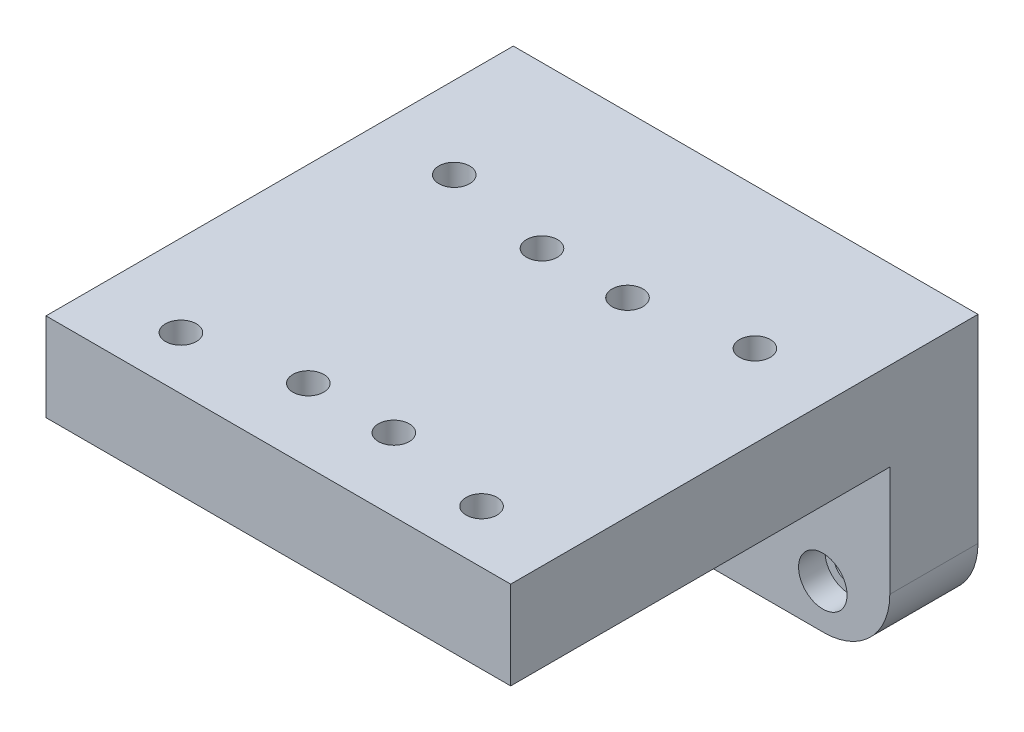
ISO-10303-21;
HEADER;
FILE_DESCRIPTION(('STEP AP214'),'2;1');
FILE_NAME('part.step','',(''),(''),'','','');
FILE_SCHEMA(('AUTOMOTIVE_DESIGN { 1 0 10303 214 1 1 1 1 }'));
ENDSEC;
DATA;
#1=APPLICATION_CONTEXT('core data for automotive mechanical design processes');
#2=APPLICATION_PROTOCOL_DEFINITION('international standard','automotive_design',2000,#1);
#3=PRODUCT_CONTEXT('',#1,'mechanical');
#4=PRODUCT('Part','Part','',(#3));
#5=PRODUCT_RELATED_PRODUCT_CATEGORY('part','',(#4));
#6=PRODUCT_DEFINITION_FORMATION('','',#4);
#7=PRODUCT_DEFINITION_CONTEXT('part definition',#1,'design');
#8=PRODUCT_DEFINITION('design','',#6,#7);
#9=PRODUCT_DEFINITION_SHAPE('','',#8);
#10=(LENGTH_UNIT() NAMED_UNIT(*) SI_UNIT(.MILLI.,.METRE.));
#11=(NAMED_UNIT(*) PLANE_ANGLE_UNIT() SI_UNIT($,.RADIAN.));
#12=(NAMED_UNIT(*) SI_UNIT($,.STERADIAN.) SOLID_ANGLE_UNIT());
#13=UNCERTAINTY_MEASURE_WITH_UNIT(LENGTH_MEASURE(1.E-05),#10,'distance_accuracy_value','');
#14=(GEOMETRIC_REPRESENTATION_CONTEXT(3) GLOBAL_UNCERTAINTY_ASSIGNED_CONTEXT((#13)) GLOBAL_UNIT_ASSIGNED_CONTEXT((#10,
#11,#12)) REPRESENTATION_CONTEXT('',''));
#15=CARTESIAN_POINT('',(0.,0.,0.));
#16=DIRECTION('',(0.,0.,1.));
#17=DIRECTION('',(1.,0.,0.));
#18=AXIS2_PLACEMENT_3D('',#15,#16,#17);
#19=CARTESIAN_POINT('',(0.,13.,0.));
#20=DIRECTION('',(0.,-1.,0.));
#21=DIRECTION('',(0.,0.,-1.));
#22=AXIS2_PLACEMENT_3D('',#19,#20,#21);
#23=PLANE('',#22);
#24=CARTESIAN_POINT('',(34.1,13.,31.));
#25=DIRECTION('',(0.,1.,0.));
#26=DIRECTION('',(0.,0.,-1.));
#27=AXIS2_PLACEMENT_3D('',#24,#25,#26);
#28=CIRCLE('',#27,3.5);
#29=CARTESIAN_POINT('',(34.1,13.,27.5));
#30=VERTEX_POINT('',#29);
#31=EDGE_CURVE('E243',#30,#30,#28,.T.);
#32=ORIENTED_EDGE('',*,*,#31,.F.);
#33=EDGE_LOOP('',(#32));
#34=FACE_BOUND('',#33,.T.);
#35=CARTESIAN_POINT('',(9.70000000000002,13.,26.5));
#36=DIRECTION('',(0.,1.,0.));
#37=DIRECTION('',(0.,0.,-1.));
#38=AXIS2_PLACEMENT_3D('',#35,#36,#37);
#39=CIRCLE('',#38,3.5);
#40=CARTESIAN_POINT('',(9.70000000000002,13.,23.));
#41=VERTEX_POINT('',#40);
#42=EDGE_CURVE('E220',#41,#41,#39,.T.);
#43=ORIENTED_EDGE('',*,*,#42,.F.);
#44=EDGE_LOOP('',(#43));
#45=FACE_BOUND('',#44,.T.);
#46=CARTESIAN_POINT('',(34.1,13.,-31.));
#47=DIRECTION('',(0.,-1.,0.));
#48=DIRECTION('',(0.,0.,1.));
#49=AXIS2_PLACEMENT_3D('',#46,#47,#48);
#50=CIRCLE('',#49,3.5);
#51=CARTESIAN_POINT('',(34.1,13.,-27.5));
#52=VERTEX_POINT('',#51);
#53=EDGE_CURVE('E259',#52,#52,#50,.T.);
#54=ORIENTED_EDGE('',*,*,#53,.T.);
#55=EDGE_LOOP('',(#54));
#56=FACE_BOUND('',#55,.T.);
#57=CARTESIAN_POINT('',(9.70000000000002,13.,-26.5));
#58=DIRECTION('',(0.,-1.,0.));
#59=DIRECTION('',(0.,0.,1.));
#60=AXIS2_PLACEMENT_3D('',#57,#58,#59);
#61=CIRCLE('',#60,3.5);
#62=CARTESIAN_POINT('',(9.70000000000002,13.,-23.));
#63=VERTEX_POINT('',#62);
#64=EDGE_CURVE('E242',#63,#63,#61,.T.);
#65=ORIENTED_EDGE('',*,*,#64,.T.);
#66=EDGE_LOOP('',(#65));
#67=FACE_BOUND('',#66,.T.);
#68=CARTESIAN_POINT('',(-34.1,13.,31.));
#69=DIRECTION('',(0.,-1.,0.));
#70=DIRECTION('',(0.,0.,-1.));
#71=AXIS2_PLACEMENT_3D('',#68,#69,#70);
#72=CIRCLE('',#71,3.5);
#73=CARTESIAN_POINT('',(-34.1,13.,27.5));
#74=VERTEX_POINT('',#73);
#75=EDGE_CURVE('E275',#74,#74,#72,.T.);
#76=ORIENTED_EDGE('',*,*,#75,.T.);
#77=EDGE_LOOP('',(#76));
#78=FACE_BOUND('',#77,.T.);
#79=CARTESIAN_POINT('',(-9.70000000000002,13.,26.5));
#80=DIRECTION('',(0.,-1.,0.));
#81=DIRECTION('',(0.,0.,-1.));
#82=AXIS2_PLACEMENT_3D('',#79,#80,#81);
#83=CIRCLE('',#82,3.5);
#84=CARTESIAN_POINT('',(-9.70000000000002,13.,23.));
#85=VERTEX_POINT('',#84);
#86=EDGE_CURVE('E258',#85,#85,#83,.T.);
#87=ORIENTED_EDGE('',*,*,#86,.T.);
#88=EDGE_LOOP('',(#87));
#89=FACE_BOUND('',#88,.T.);
#90=CARTESIAN_POINT('',(-34.1,13.,-31.));
#91=DIRECTION('',(0.,1.,0.));
#92=DIRECTION('',(0.,0.,1.));
#93=AXIS2_PLACEMENT_3D('',#90,#91,#92);
#94=CIRCLE('',#93,3.5);
#95=CARTESIAN_POINT('',(-34.1,13.,-27.5));
#96=VERTEX_POINT('',#95);
#97=EDGE_CURVE('E291',#96,#96,#94,.T.);
#98=ORIENTED_EDGE('',*,*,#97,.F.);
#99=EDGE_LOOP('',(#98));
#100=FACE_BOUND('',#99,.T.);
#101=CARTESIAN_POINT('',(-9.70000000000002,13.,-26.5));
#102=DIRECTION('',(0.,1.,0.));
#103=DIRECTION('',(0.,0.,1.));
#104=AXIS2_PLACEMENT_3D('',#101,#102,#103);
#105=CIRCLE('',#104,3.5);
#106=CARTESIAN_POINT('',(-9.70000000000002,13.,-23.));
#107=VERTEX_POINT('',#106);
#108=EDGE_CURVE('E295',#107,#107,#105,.T.);
#109=ORIENTED_EDGE('',*,*,#108,.F.);
#110=EDGE_LOOP('',(#109));
#111=FACE_BOUND('',#110,.T.);
#112=DIRECTION('',(0.,0.,1.));
#113=VECTOR('',#112,1.);
#114=CARTESIAN_POINT('',(-52.7,13.,0.));
#115=LINE('',#114,#113);
#116=CARTESIAN_POINT('',(-52.7,13.,-63.));
#117=VERTEX_POINT('',#116);
#118=CARTESIAN_POINT('',(-52.7,13.,43.));
#119=VERTEX_POINT('',#118);
#120=EDGE_CURVE('E176',#117,#119,#115,.T.);
#121=ORIENTED_EDGE('',*,*,#120,.T.);
#122=DIRECTION('',(1.,0.,0.));
#123=VECTOR('',#122,1.);
#124=CARTESIAN_POINT('',(0.,13.,43.));
#125=LINE('',#124,#123);
#126=CARTESIAN_POINT('',(52.7,13.,43.));
#127=VERTEX_POINT('',#126);
#128=EDGE_CURVE('E154',#119,#127,#125,.T.);
#129=ORIENTED_EDGE('',*,*,#128,.T.);
#130=DIRECTION('',(0.,0.,-1.));
#131=VECTOR('',#130,1.);
#132=CARTESIAN_POINT('',(52.7,13.,0.));
#133=LINE('',#132,#131);
#134=CARTESIAN_POINT('',(52.7,13.,-63.));
#135=VERTEX_POINT('',#134);
#136=EDGE_CURVE('E141',#127,#135,#133,.T.);
#137=ORIENTED_EDGE('',*,*,#136,.T.);
#138=DIRECTION('',(-1.,0.,0.));
#139=VECTOR('',#138,1.);
#140=CARTESIAN_POINT('',(0.,13.,-63.));
#141=LINE('',#140,#139);
#142=EDGE_CURVE('E152',#135,#117,#141,.T.);
#143=ORIENTED_EDGE('',*,*,#142,.T.);
#144=EDGE_LOOP('',(#121,#129,#137,#143));
#145=FACE_BOUND('',#144,.T.);
#146=ADVANCED_FACE('F45',(#34,#45,#56,#67,#78,#89,#100,#111,#145),#23,.F.);
#147=CARTESIAN_POINT('',(0.,0.,0.));
#148=DIRECTION('',(0.,-1.,0.));
#149=DIRECTION('',(0.,0.,-1.));
#150=AXIS2_PLACEMENT_3D('',#147,#148,#149);
#151=PLANE('',#150);
#152=CARTESIAN_POINT('',(34.1,0.,31.));
#153=DIRECTION('',(0.,1.,0.));
#154=DIRECTION('',(0.,0.,-1.));
#155=AXIS2_PLACEMENT_3D('',#152,#153,#154);
#156=CIRCLE('',#155,3.5);
#157=CARTESIAN_POINT('',(34.1,0.,27.5));
#158=VERTEX_POINT('',#157);
#159=EDGE_CURVE('E238',#158,#158,#156,.T.);
#160=ORIENTED_EDGE('',*,*,#159,.T.);
#161=EDGE_LOOP('',(#160));
#162=FACE_BOUND('',#161,.T.);
#163=CARTESIAN_POINT('',(9.70000000000002,0.,26.5));
#164=DIRECTION('',(0.,1.,0.));
#165=DIRECTION('',(0.,0.,-1.));
#166=AXIS2_PLACEMENT_3D('',#163,#164,#165);
#167=CIRCLE('',#166,3.5);
#168=CARTESIAN_POINT('',(9.70000000000002,0.,23.));
#169=VERTEX_POINT('',#168);
#170=EDGE_CURVE('E247',#169,#169,#167,.T.);
#171=ORIENTED_EDGE('',*,*,#170,.T.);
#172=EDGE_LOOP('',(#171));
#173=FACE_BOUND('',#172,.T.);
#174=CARTESIAN_POINT('',(34.1,0.,-31.));
#175=DIRECTION('',(0.,-1.,0.));
#176=DIRECTION('',(0.,0.,1.));
#177=AXIS2_PLACEMENT_3D('',#174,#175,#176);
#178=CIRCLE('',#177,3.5);
#179=CARTESIAN_POINT('',(34.1,0.,-27.5));
#180=VERTEX_POINT('',#179);
#181=EDGE_CURVE('E254',#180,#180,#178,.T.);
#182=ORIENTED_EDGE('',*,*,#181,.F.);
#183=EDGE_LOOP('',(#182));
#184=FACE_BOUND('',#183,.T.);
#185=CARTESIAN_POINT('',(9.70000000000002,0.,-26.5));
#186=DIRECTION('',(0.,-1.,0.));
#187=DIRECTION('',(0.,0.,1.));
#188=AXIS2_PLACEMENT_3D('',#185,#186,#187);
#189=CIRCLE('',#188,3.5);
#190=CARTESIAN_POINT('',(9.70000000000002,0.,-23.));
#191=VERTEX_POINT('',#190);
#192=EDGE_CURVE('E263',#191,#191,#189,.T.);
#193=ORIENTED_EDGE('',*,*,#192,.F.);
#194=EDGE_LOOP('',(#193));
#195=FACE_BOUND('',#194,.T.);
#196=CARTESIAN_POINT('',(-34.1,0.,31.));
#197=DIRECTION('',(0.,-1.,0.));
#198=DIRECTION('',(0.,0.,-1.));
#199=AXIS2_PLACEMENT_3D('',#196,#197,#198);
#200=CIRCLE('',#199,3.5);
#201=CARTESIAN_POINT('',(-34.1,0.,27.5));
#202=VERTEX_POINT('',#201);
#203=EDGE_CURVE('E270',#202,#202,#200,.T.);
#204=ORIENTED_EDGE('',*,*,#203,.F.);
#205=EDGE_LOOP('',(#204));
#206=FACE_BOUND('',#205,.T.);
#207=CARTESIAN_POINT('',(-9.70000000000002,0.,26.5));
#208=DIRECTION('',(0.,-1.,0.));
#209=DIRECTION('',(0.,0.,-1.));
#210=AXIS2_PLACEMENT_3D('',#207,#208,#209);
#211=CIRCLE('',#210,3.5);
#212=CARTESIAN_POINT('',(-9.70000000000002,0.,23.));
#213=VERTEX_POINT('',#212);
#214=EDGE_CURVE('E279',#213,#213,#211,.T.);
#215=ORIENTED_EDGE('',*,*,#214,.F.);
#216=EDGE_LOOP('',(#215));
#217=FACE_BOUND('',#216,.T.);
#218=CARTESIAN_POINT('',(-34.1,0.,-31.));
#219=DIRECTION('',(0.,1.,0.));
#220=DIRECTION('',(0.,0.,1.));
#221=AXIS2_PLACEMENT_3D('',#218,#219,#220);
#222=CIRCLE('',#221,3.5);
#223=CARTESIAN_POINT('',(-34.1,0.,-27.5));
#224=VERTEX_POINT('',#223);
#225=EDGE_CURVE('E286',#224,#224,#222,.T.);
#226=ORIENTED_EDGE('',*,*,#225,.T.);
#227=EDGE_LOOP('',(#226));
#228=FACE_BOUND('',#227,.T.);
#229=CARTESIAN_POINT('',(-9.70000000000002,0.,-26.5));
#230=DIRECTION('',(0.,1.,0.));
#231=DIRECTION('',(0.,0.,1.));
#232=AXIS2_PLACEMENT_3D('',#229,#230,#231);
#233=CIRCLE('',#232,3.5);
#234=CARTESIAN_POINT('',(-9.70000000000002,0.,-23.));
#235=VERTEX_POINT('',#234);
#236=EDGE_CURVE('E274',#235,#235,#233,.T.);
#237=ORIENTED_EDGE('',*,*,#236,.T.);
#238=EDGE_LOOP('',(#237));
#239=FACE_BOUND('',#238,.T.);
#240=DIRECTION('',(0.,0.,-1.));
#241=VECTOR('',#240,1.);
#242=CARTESIAN_POINT('',(47.7,0.,38.));
#243=LINE('',#242,#241);
#244=CARTESIAN_POINT('',(47.7,0.,38.));
#245=VERTEX_POINT('',#244);
#246=CARTESIAN_POINT('',(47.7,0.,-38.));
#247=VERTEX_POINT('',#246);
#248=EDGE_CURVE('E290',#245,#247,#243,.T.);
#249=ORIENTED_EDGE('',*,*,#248,.F.);
#250=DIRECTION('',(1.,0.,0.));
#251=VECTOR('',#250,1.);
#252=CARTESIAN_POINT('',(-47.7,0.,38.));
#253=LINE('',#252,#251);
#254=CARTESIAN_POINT('',(-47.7,0.,38.));
#255=VERTEX_POINT('',#254);
#256=EDGE_CURVE('E313',#255,#245,#253,.T.);
#257=ORIENTED_EDGE('',*,*,#256,.F.);
#258=DIRECTION('',(0.,0.,1.));
#259=VECTOR('',#258,1.);
#260=CARTESIAN_POINT('',(-47.7,0.,38.));
#261=LINE('',#260,#259);
#262=CARTESIAN_POINT('',(-47.7,0.,-38.));
#263=VERTEX_POINT('',#262);
#264=EDGE_CURVE('E309',#263,#255,#261,.T.);
#265=ORIENTED_EDGE('',*,*,#264,.F.);
#266=DIRECTION('',(-1.,0.,0.));
#267=VECTOR('',#266,1.);
#268=CARTESIAN_POINT('',(-47.7,0.,-38.));
#269=LINE('',#268,#267);
#270=EDGE_CURVE('E305',#247,#263,#269,.T.);
#271=ORIENTED_EDGE('',*,*,#270,.F.);
#272=EDGE_LOOP('',(#249,#257,#265,#271));
#273=FACE_BOUND('',#272,.T.);
#274=ADVANCED_FACE('F366',(#162,#173,#184,#195,#206,#217,#228,#239,#273),#151,.T.);
#275=CARTESIAN_POINT('',(-9.70000000000002,0.,-26.5));
#276=DIRECTION('',(0.,1.,0.));
#277=DIRECTION('',(0.,0.,1.));
#278=AXIS2_PLACEMENT_3D('',#275,#276,#277);
#279=CYLINDRICAL_SURFACE('',#278,3.5);
#280=ORIENTED_EDGE('',*,*,#236,.F.);
#281=EDGE_LOOP('',(#280));
#282=FACE_BOUND('',#281,.T.);
#283=ORIENTED_EDGE('',*,*,#108,.T.);
#284=EDGE_LOOP('',(#283));
#285=FACE_BOUND('',#284,.T.);
#286=ADVANCED_FACE('F372',(#282,#285),#279,.F.);
#287=CARTESIAN_POINT('',(-34.1,0.,-31.));
#288=DIRECTION('',(0.,1.,0.));
#289=DIRECTION('',(0.,0.,1.));
#290=AXIS2_PLACEMENT_3D('',#287,#288,#289);
#291=CYLINDRICAL_SURFACE('',#290,3.5);
#292=ORIENTED_EDGE('',*,*,#225,.F.);
#293=EDGE_LOOP('',(#292));
#294=FACE_BOUND('',#293,.T.);
#295=ORIENTED_EDGE('',*,*,#97,.T.);
#296=EDGE_LOOP('',(#295));
#297=FACE_BOUND('',#296,.T.);
#298=ADVANCED_FACE('F470',(#294,#297),#291,.F.);
#299=CARTESIAN_POINT('',(-9.70000000000002,0.,26.5));
#300=DIRECTION('',(0.,1.,0.));
#301=DIRECTION('',(0.,0.,1.));
#302=AXIS2_PLACEMENT_3D('',#299,#300,#301);
#303=CYLINDRICAL_SURFACE('',#302,3.5);
#304=ORIENTED_EDGE('',*,*,#214,.T.);
#305=EDGE_LOOP('',(#304));
#306=FACE_BOUND('',#305,.T.);
#307=ORIENTED_EDGE('',*,*,#86,.F.);
#308=EDGE_LOOP('',(#307));
#309=FACE_BOUND('',#308,.T.);
#310=ADVANCED_FACE('F467',(#306,#309),#303,.F.);
#311=CARTESIAN_POINT('',(-34.1,0.,31.));
#312=DIRECTION('',(0.,1.,0.));
#313=DIRECTION('',(0.,0.,1.));
#314=AXIS2_PLACEMENT_3D('',#311,#312,#313);
#315=CYLINDRICAL_SURFACE('',#314,3.5);
#316=ORIENTED_EDGE('',*,*,#203,.T.);
#317=EDGE_LOOP('',(#316));
#318=FACE_BOUND('',#317,.T.);
#319=ORIENTED_EDGE('',*,*,#75,.F.);
#320=EDGE_LOOP('',(#319));
#321=FACE_BOUND('',#320,.T.);
#322=ADVANCED_FACE('F463',(#318,#321),#315,.F.);
#323=CARTESIAN_POINT('',(9.70000000000002,0.,-26.5));
#324=DIRECTION('',(0.,1.,0.));
#325=DIRECTION('',(0.,0.,1.));
#326=AXIS2_PLACEMENT_3D('',#323,#324,#325);
#327=CYLINDRICAL_SURFACE('',#326,3.5);
#328=ORIENTED_EDGE('',*,*,#192,.T.);
#329=EDGE_LOOP('',(#328));
#330=FACE_BOUND('',#329,.T.);
#331=ORIENTED_EDGE('',*,*,#64,.F.);
#332=EDGE_LOOP('',(#331));
#333=FACE_BOUND('',#332,.T.);
#334=ADVANCED_FACE('F459',(#330,#333),#327,.F.);
#335=CARTESIAN_POINT('',(34.1,0.,-31.));
#336=DIRECTION('',(0.,1.,0.));
#337=DIRECTION('',(0.,0.,1.));
#338=AXIS2_PLACEMENT_3D('',#335,#336,#337);
#339=CYLINDRICAL_SURFACE('',#338,3.5);
#340=ORIENTED_EDGE('',*,*,#181,.T.);
#341=EDGE_LOOP('',(#340));
#342=FACE_BOUND('',#341,.T.);
#343=ORIENTED_EDGE('',*,*,#53,.F.);
#344=EDGE_LOOP('',(#343));
#345=FACE_BOUND('',#344,.T.);
#346=ADVANCED_FACE('F451',(#342,#345),#339,.F.);
#347=CARTESIAN_POINT('',(9.70000000000002,0.,26.5));
#348=DIRECTION('',(0.,1.,0.));
#349=DIRECTION('',(0.,0.,1.));
#350=AXIS2_PLACEMENT_3D('',#347,#348,#349);
#351=CYLINDRICAL_SURFACE('',#350,3.5);
#352=ORIENTED_EDGE('',*,*,#170,.F.);
#353=EDGE_LOOP('',(#352));
#354=FACE_BOUND('',#353,.T.);
#355=ORIENTED_EDGE('',*,*,#42,.T.);
#356=EDGE_LOOP('',(#355));
#357=FACE_BOUND('',#356,.T.);
#358=ADVANCED_FACE('F437',(#354,#357),#351,.F.);
#359=CARTESIAN_POINT('',(34.1,0.,31.));
#360=DIRECTION('',(0.,1.,0.));
#361=DIRECTION('',(0.,0.,1.));
#362=AXIS2_PLACEMENT_3D('',#359,#360,#361);
#363=CYLINDRICAL_SURFACE('',#362,3.5);
#364=ORIENTED_EDGE('',*,*,#159,.F.);
#365=EDGE_LOOP('',(#364));
#366=FACE_BOUND('',#365,.T.);
#367=ORIENTED_EDGE('',*,*,#31,.T.);
#368=EDGE_LOOP('',(#367));
#369=FACE_BOUND('',#368,.T.);
#370=ADVANCED_FACE('F432',(#366,#369),#363,.F.);
#371=CARTESIAN_POINT('',(47.7,-7.,0.));
#372=DIRECTION('',(1.,0.,0.));
#373=DIRECTION('',(0.,0.,-1.));
#374=AXIS2_PLACEMENT_3D('',#371,#372,#373);
#375=PLANE('',#374);
#376=ORIENTED_EDGE('',*,*,#248,.T.);
#377=DIRECTION('',(0.,1.,0.));
#378=VECTOR('',#377,1.);
#379=CARTESIAN_POINT('',(47.7,-7.,-38.));
#380=LINE('',#379,#378);
#381=CARTESIAN_POINT('',(47.7,-7.,-38.));
#382=VERTEX_POINT('',#381);
#383=EDGE_CURVE('E216',#382,#247,#380,.T.);
#384=ORIENTED_EDGE('',*,*,#383,.F.);
#385=DIRECTION('',(0.,0.,-1.));
#386=VECTOR('',#385,1.);
#387=CARTESIAN_POINT('',(47.7,-7.,0.));
#388=LINE('',#387,#386);
#389=CARTESIAN_POINT('',(47.7,-7.,38.));
#390=VERTEX_POINT('',#389);
#391=EDGE_CURVE('E198',#390,#382,#388,.T.);
#392=ORIENTED_EDGE('',*,*,#391,.F.);
#393=DIRECTION('',(0.,1.,0.));
#394=VECTOR('',#393,1.);
#395=CARTESIAN_POINT('',(47.7,-7.,38.));
#396=LINE('',#395,#394);
#397=EDGE_CURVE('E229',#390,#245,#396,.T.);
#398=ORIENTED_EDGE('',*,*,#397,.T.);
#399=EDGE_LOOP('',(#376,#384,#392,#398));
#400=FACE_BOUND('',#399,.T.);
#401=ADVANCED_FACE('F426',(#400),#375,.F.);
#402=CARTESIAN_POINT('',(0.,-7.,-38.));
#403=DIRECTION('',(0.,0.,-1.));
#404=DIRECTION('',(-1.,0.,0.));
#405=AXIS2_PLACEMENT_3D('',#402,#403,#404);
#406=PLANE('',#405);
#407=ORIENTED_EDGE('',*,*,#270,.T.);
#408=DIRECTION('',(0.,1.,0.));
#409=VECTOR('',#408,1.);
#410=CARTESIAN_POINT('',(-47.7,-7.,-38.));
#411=LINE('',#410,#409);
#412=CARTESIAN_POINT('',(-47.7,-7.,-38.));
#413=VERTEX_POINT('',#412);
#414=EDGE_CURVE('E221',#413,#263,#411,.T.);
#415=ORIENTED_EDGE('',*,*,#414,.F.);
#416=DIRECTION('',(-1.,0.,0.));
#417=VECTOR('',#416,1.);
#418=CARTESIAN_POINT('',(0.,-7.,-38.));
#419=LINE('',#418,#417);
#420=EDGE_CURVE('E208',#382,#413,#419,.T.);
#421=ORIENTED_EDGE('',*,*,#420,.F.);
#422=ORIENTED_EDGE('',*,*,#383,.T.);
#423=EDGE_LOOP('',(#407,#415,#421,#422));
#424=FACE_BOUND('',#423,.T.);
#425=ADVANCED_FACE('F422',(#424),#406,.F.);
#426=CARTESIAN_POINT('',(-47.7,-7.,0.));
#427=DIRECTION('',(-1.,0.,0.));
#428=DIRECTION('',(0.,0.,1.));
#429=AXIS2_PLACEMENT_3D('',#426,#427,#428);
#430=PLANE('',#429);
#431=ORIENTED_EDGE('',*,*,#264,.T.);
#432=DIRECTION('',(0.,1.,0.));
#433=VECTOR('',#432,1.);
#434=CARTESIAN_POINT('',(-47.7,-7.,38.));
#435=LINE('',#434,#433);
#436=CARTESIAN_POINT('',(-47.7,-7.,38.));
#437=VERTEX_POINT('',#436);
#438=EDGE_CURVE('E225',#437,#255,#435,.T.);
#439=ORIENTED_EDGE('',*,*,#438,.F.);
#440=DIRECTION('',(0.,0.,1.));
#441=VECTOR('',#440,1.);
#442=CARTESIAN_POINT('',(-47.7,-7.,0.));
#443=LINE('',#442,#441);
#444=EDGE_CURVE('E205',#413,#437,#443,.T.);
#445=ORIENTED_EDGE('',*,*,#444,.F.);
#446=ORIENTED_EDGE('',*,*,#414,.T.);
#447=EDGE_LOOP('',(#431,#439,#445,#446));
#448=FACE_BOUND('',#447,.T.);
#449=ADVANCED_FACE('F425',(#448),#430,.F.);
#450=CARTESIAN_POINT('',(-52.7,-7.,0.));
#451=DIRECTION('',(-1.,0.,0.));
#452=DIRECTION('',(0.,0.,1.));
#453=AXIS2_PLACEMENT_3D('',#450,#451,#452);
#454=PLANE('',#453);
#455=DIRECTION('',(0.,1.,0.));
#456=VECTOR('',#455,1.);
#457=CARTESIAN_POINT('',(-52.7,-47.,-63.));
#458=LINE('',#457,#456);
#459=CARTESIAN_POINT('',(-52.7,-32.,-63.));
#460=VERTEX_POINT('',#459);
#461=EDGE_CURVE('E146',#460,#117,#458,.T.);
#462=ORIENTED_EDGE('',*,*,#461,.F.);
#463=DIRECTION('',(0.,0.,1.));
#464=VECTOR('',#463,1.);
#465=CARTESIAN_POINT('',(-52.7,-32.,-43.));
#466=LINE('',#465,#464);
#467=CARTESIAN_POINT('',(-52.7,-32.,-43.));
#468=VERTEX_POINT('',#467);
#469=EDGE_CURVE('E317',#460,#468,#466,.T.);
#470=ORIENTED_EDGE('',*,*,#469,.T.);
#471=DIRECTION('',(0.,1.,0.));
#472=VECTOR('',#471,1.);
#473=CARTESIAN_POINT('',(-52.7,-47.,-43.));
#474=LINE('',#473,#472);
#475=CARTESIAN_POINT('',(-52.7,-7.,-43.));
#476=VERTEX_POINT('',#475);
#477=EDGE_CURVE('E180',#468,#476,#474,.T.);
#478=ORIENTED_EDGE('',*,*,#477,.T.);
#479=DIRECTION('',(0.,0.,1.));
#480=VECTOR('',#479,1.);
#481=CARTESIAN_POINT('',(-52.7,-7.,0.));
#482=LINE('',#481,#480);
#483=CARTESIAN_POINT('',(-52.7,-7.,43.));
#484=VERTEX_POINT('',#483);
#485=EDGE_CURVE('E156',#476,#484,#482,.T.);
#486=ORIENTED_EDGE('',*,*,#485,.T.);
#487=DIRECTION('',(0.,1.,0.));
#488=VECTOR('',#487,1.);
#489=CARTESIAN_POINT('',(-52.7,-7.,43.));
#490=LINE('',#489,#488);
#491=EDGE_CURVE('E211',#484,#119,#490,.T.);
#492=ORIENTED_EDGE('',*,*,#491,.T.);
#493=ORIENTED_EDGE('',*,*,#120,.F.);
#494=EDGE_LOOP('',(#462,#470,#478,#486,#492,#493));
#495=FACE_BOUND('',#494,.T.);
#496=ADVANCED_FACE('F338',(#495),#454,.T.);
#497=CARTESIAN_POINT('',(52.7,-7.,0.));
#498=DIRECTION('',(1.,0.,0.));
#499=DIRECTION('',(0.,0.,-1.));
#500=AXIS2_PLACEMENT_3D('',#497,#498,#499);
#501=PLANE('',#500);
#502=DIRECTION('',(0.,1.,0.));
#503=VECTOR('',#502,1.);
#504=CARTESIAN_POINT('',(52.7,-47.,-43.));
#505=LINE('',#504,#503);
#506=CARTESIAN_POINT('',(52.7,-32.,-43.));
#507=VERTEX_POINT('',#506);
#508=CARTESIAN_POINT('',(52.7,-7.,-43.));
#509=VERTEX_POINT('',#508);
#510=EDGE_CURVE('E147',#507,#509,#505,.T.);
#511=ORIENTED_EDGE('',*,*,#510,.F.);
#512=DIRECTION('',(0.,0.,-1.));
#513=VECTOR('',#512,1.);
#514=CARTESIAN_POINT('',(52.7,-32.,-63.));
#515=LINE('',#514,#513);
#516=CARTESIAN_POINT('',(52.7,-32.,-63.));
#517=VERTEX_POINT('',#516);
#518=EDGE_CURVE('E11',#507,#517,#515,.T.);
#519=ORIENTED_EDGE('',*,*,#518,.T.);
#520=DIRECTION('',(0.,1.,0.));
#521=VECTOR('',#520,1.);
#522=CARTESIAN_POINT('',(52.7,-47.,-63.));
#523=LINE('',#522,#521);
#524=EDGE_CURVE('E137',#517,#135,#523,.T.);
#525=ORIENTED_EDGE('',*,*,#524,.T.);
#526=ORIENTED_EDGE('',*,*,#136,.F.);
#527=DIRECTION('',(0.,1.,0.));
#528=VECTOR('',#527,1.);
#529=CARTESIAN_POINT('',(52.7,-7.,43.));
#530=LINE('',#529,#528);
#531=CARTESIAN_POINT('',(52.7,-7.,43.));
#532=VERTEX_POINT('',#531);
#533=EDGE_CURVE('E233',#532,#127,#530,.T.);
#534=ORIENTED_EDGE('',*,*,#533,.F.);
#535=DIRECTION('',(0.,0.,-1.));
#536=VECTOR('',#535,1.);
#537=CARTESIAN_POINT('',(52.7,-7.,0.));
#538=LINE('',#537,#536);
#539=EDGE_CURVE('E190',#532,#509,#538,.T.);
#540=ORIENTED_EDGE('',*,*,#539,.T.);
#541=EDGE_LOOP('',(#511,#519,#525,#526,#534,#540));
#542=FACE_BOUND('',#541,.T.);
#543=ADVANCED_FACE('F140',(#542),#501,.T.);
#544=CARTESIAN_POINT('',(0.,-7.,43.));
#545=DIRECTION('',(0.,0.,1.));
#546=DIRECTION('',(1.,0.,0.));
#547=AXIS2_PLACEMENT_3D('',#544,#545,#546);
#548=PLANE('',#547);
#549=ORIENTED_EDGE('',*,*,#128,.F.);
#550=ORIENTED_EDGE('',*,*,#491,.F.);
#551=DIRECTION('',(1.,0.,0.));
#552=VECTOR('',#551,1.);
#553=CARTESIAN_POINT('',(0.,-7.,43.));
#554=LINE('',#553,#552);
#555=EDGE_CURVE('E186',#484,#532,#554,.T.);
#556=ORIENTED_EDGE('',*,*,#555,.T.);
#557=ORIENTED_EDGE('',*,*,#533,.T.);
#558=EDGE_LOOP('',(#549,#550,#556,#557));
#559=FACE_BOUND('',#558,.T.);
#560=ADVANCED_FACE('F353',(#559),#548,.T.);
#561=CARTESIAN_POINT('',(0.,-7.,38.));
#562=DIRECTION('',(0.,0.,1.));
#563=DIRECTION('',(1.,0.,0.));
#564=AXIS2_PLACEMENT_3D('',#561,#562,#563);
#565=PLANE('',#564);
#566=ORIENTED_EDGE('',*,*,#256,.T.);
#567=ORIENTED_EDGE('',*,*,#397,.F.);
#568=DIRECTION('',(1.,0.,0.));
#569=VECTOR('',#568,1.);
#570=CARTESIAN_POINT('',(0.,-7.,38.));
#571=LINE('',#570,#569);
#572=EDGE_CURVE('E202',#437,#390,#571,.T.);
#573=ORIENTED_EDGE('',*,*,#572,.F.);
#574=ORIENTED_EDGE('',*,*,#438,.T.);
#575=EDGE_LOOP('',(#566,#567,#573,#574));
#576=FACE_BOUND('',#575,.T.);
#577=ADVANCED_FACE('F355',(#576),#565,.F.);
#578=CARTESIAN_POINT('',(0.,-7.,0.));
#579=DIRECTION('',(0.,1.,0.));
#580=DIRECTION('',(0.,0.,1.));
#581=AXIS2_PLACEMENT_3D('',#578,#579,#580);
#582=PLANE('',#581);
#583=ORIENTED_EDGE('',*,*,#485,.F.);
#584=DIRECTION('',(1.,0.,0.));
#585=VECTOR('',#584,1.);
#586=CARTESIAN_POINT('',(0.,-7.,-43.));
#587=LINE('',#586,#585);
#588=EDGE_CURVE('E194',#476,#509,#587,.T.);
#589=ORIENTED_EDGE('',*,*,#588,.T.);
#590=ORIENTED_EDGE('',*,*,#539,.F.);
#591=ORIENTED_EDGE('',*,*,#555,.F.);
#592=EDGE_LOOP('',(#583,#589,#590,#591));
#593=FACE_BOUND('',#592,.T.);
#594=ORIENTED_EDGE('',*,*,#391,.T.);
#595=ORIENTED_EDGE('',*,*,#420,.T.);
#596=ORIENTED_EDGE('',*,*,#444,.T.);
#597=ORIENTED_EDGE('',*,*,#572,.T.);
#598=EDGE_LOOP('',(#594,#595,#596,#597));
#599=FACE_BOUND('',#598,.T.);
#600=ADVANCED_FACE('F350',(#593,#599),#582,.F.);
#601=CARTESIAN_POINT('',(0.,-47.,-43.));
#602=DIRECTION('',(0.,0.,1.));
#603=DIRECTION('',(1.,0.,0.));
#604=AXIS2_PLACEMENT_3D('',#601,#602,#603);
#605=PLANE('',#604);
#606=CARTESIAN_POINT('',(37.5,-37.,-43.));
#607=DIRECTION('',(0.,0.,1.));
#608=DIRECTION('',(1.,0.,0.));
#609=AXIS2_PLACEMENT_3D('',#606,#607,#608);
#610=CIRCLE('',#609,5.5);
#611=CARTESIAN_POINT('',(43.,-37.,-43.));
#612=VERTEX_POINT('',#611);
#613=EDGE_CURVE('E746',#612,#612,#610,.T.);
#614=ORIENTED_EDGE('',*,*,#613,.F.);
#615=EDGE_LOOP('',(#614));
#616=FACE_BOUND('',#615,.T.);
#617=CARTESIAN_POINT('',(-37.5,-37.,-43.));
#618=DIRECTION('',(0.,0.,1.));
#619=DIRECTION('',(1.,0.,0.));
#620=AXIS2_PLACEMENT_3D('',#617,#618,#619);
#621=CIRCLE('',#620,5.5);
#622=CARTESIAN_POINT('',(-32.,-37.,-43.));
#623=VERTEX_POINT('',#622);
#624=EDGE_CURVE('E749',#623,#623,#621,.T.);
#625=ORIENTED_EDGE('',*,*,#624,.F.);
#626=EDGE_LOOP('',(#625));
#627=FACE_BOUND('',#626,.T.);
#628=ORIENTED_EDGE('',*,*,#477,.F.);
#629=CARTESIAN_POINT('',(-37.7,-32.,-43.));
#630=DIRECTION('',(0.,0.,1.));
#631=DIRECTION('',(1.,0.,0.));
#632=AXIS2_PLACEMENT_3D('',#629,#630,#631);
#633=CIRCLE('',#632,15.);
#634=CARTESIAN_POINT('',(-37.7,-47.,-43.));
#635=VERTEX_POINT('',#634);
#636=EDGE_CURVE('E324',#468,#635,#633,.T.);
#637=ORIENTED_EDGE('',*,*,#636,.T.);
#638=DIRECTION('',(1.,0.,0.));
#639=VECTOR('',#638,1.);
#640=CARTESIAN_POINT('',(0.,-47.,-43.));
#641=LINE('',#640,#639);
#642=CARTESIAN_POINT('',(37.7,-47.,-43.));
#643=VERTEX_POINT('',#642);
#644=EDGE_CURVE('E162',#635,#643,#641,.T.);
#645=ORIENTED_EDGE('',*,*,#644,.T.);
#646=CARTESIAN_POINT('',(37.7,-32.,-43.));
#647=DIRECTION('',(0.,0.,1.));
#648=DIRECTION('',(1.,0.,0.));
#649=AXIS2_PLACEMENT_3D('',#646,#647,#648);
#650=CIRCLE('',#649,15.);
#651=EDGE_CURVE('E321',#643,#507,#650,.T.);
#652=ORIENTED_EDGE('',*,*,#651,.T.);
#653=ORIENTED_EDGE('',*,*,#510,.T.);
#654=ORIENTED_EDGE('',*,*,#588,.F.);
#655=EDGE_LOOP('',(#628,#637,#645,#652,#653,#654));
#656=FACE_BOUND('',#655,.T.);
#657=ADVANCED_FACE('F342',(#616,#627,#656),#605,.T.);
#658=CARTESIAN_POINT('',(0.,-47.,-63.));
#659=DIRECTION('',(0.,0.,-1.));
#660=DIRECTION('',(-1.,0.,0.));
#661=AXIS2_PLACEMENT_3D('',#658,#659,#660);
#662=PLANE('',#661);
#663=CARTESIAN_POINT('',(37.5,-37.,-63.));
#664=DIRECTION('',(0.,0.,1.));
#665=DIRECTION('',(1.,0.,0.));
#666=AXIS2_PLACEMENT_3D('',#663,#664,#665);
#667=CIRCLE('',#666,3.5);
#668=CARTESIAN_POINT('',(41.,-37.,-63.));
#669=VERTEX_POINT('',#668);
#670=EDGE_CURVE('E753',#669,#669,#667,.T.);
#671=ORIENTED_EDGE('',*,*,#670,.T.);
#672=EDGE_LOOP('',(#671));
#673=FACE_BOUND('',#672,.T.);
#674=CARTESIAN_POINT('',(-37.5,-37.,-63.));
#675=DIRECTION('',(0.,0.,1.));
#676=DIRECTION('',(1.,0.,0.));
#677=AXIS2_PLACEMENT_3D('',#674,#675,#676);
#678=CIRCLE('',#677,3.5);
#679=CARTESIAN_POINT('',(-34.,-37.,-63.));
#680=VERTEX_POINT('',#679);
#681=EDGE_CURVE('E163',#680,#680,#678,.T.);
#682=ORIENTED_EDGE('',*,*,#681,.T.);
#683=EDGE_LOOP('',(#682));
#684=FACE_BOUND('',#683,.T.);
#685=DIRECTION('',(-1.,0.,0.));
#686=VECTOR('',#685,1.);
#687=CARTESIAN_POINT('',(0.,-47.,-63.));
#688=LINE('',#687,#686);
#689=CARTESIAN_POINT('',(37.7,-47.,-63.));
#690=VERTEX_POINT('',#689);
#691=CARTESIAN_POINT('',(-37.7,-47.,-63.));
#692=VERTEX_POINT('',#691);
#693=EDGE_CURVE('E168',#690,#692,#688,.T.);
#694=ORIENTED_EDGE('',*,*,#693,.T.);
#695=CARTESIAN_POINT('',(-37.7,-32.,-63.));
#696=DIRECTION('',(0.,0.,-1.));
#697=DIRECTION('',(-1.,0.,0.));
#698=AXIS2_PLACEMENT_3D('',#695,#696,#697);
#699=CIRCLE('',#698,15.);
#700=EDGE_CURVE('E54',#692,#460,#699,.T.);
#701=ORIENTED_EDGE('',*,*,#700,.T.);
#702=ORIENTED_EDGE('',*,*,#461,.T.);
#703=ORIENTED_EDGE('',*,*,#142,.F.);
#704=ORIENTED_EDGE('',*,*,#524,.F.);
#705=CARTESIAN_POINT('',(37.7,-32.,-63.));
#706=DIRECTION('',(0.,0.,-1.));
#707=DIRECTION('',(-1.,0.,0.));
#708=AXIS2_PLACEMENT_3D('',#705,#706,#707);
#709=CIRCLE('',#708,15.);
#710=EDGE_CURVE('E61',#517,#690,#709,.T.);
#711=ORIENTED_EDGE('',*,*,#710,.T.);
#712=EDGE_LOOP('',(#694,#701,#702,#703,#704,#711));
#713=FACE_BOUND('',#712,.T.);
#714=ADVANCED_FACE('F158',(#673,#684,#713),#662,.T.);
#715=CARTESIAN_POINT('',(0.,-47.,0.));
#716=DIRECTION('',(0.,1.,0.));
#717=DIRECTION('',(0.,0.,1.));
#718=AXIS2_PLACEMENT_3D('',#715,#716,#717);
#719=PLANE('',#718);
#720=ORIENTED_EDGE('',*,*,#644,.F.);
#721=DIRECTION('',(0.,0.,1.));
#722=VECTOR('',#721,1.);
#723=CARTESIAN_POINT('',(-37.7,-47.,-63.));
#724=LINE('',#723,#722);
#725=EDGE_CURVE('E68',#635,#692,#724,.F.);
#726=ORIENTED_EDGE('',*,*,#725,.T.);
#727=ORIENTED_EDGE('',*,*,#693,.F.);
#728=DIRECTION('',(0.,0.,-1.));
#729=VECTOR('',#728,1.);
#730=CARTESIAN_POINT('',(37.7,-47.,-43.));
#731=LINE('',#730,#729);
#732=EDGE_CURVE('E327',#690,#643,#731,.F.);
#733=ORIENTED_EDGE('',*,*,#732,.T.);
#734=EDGE_LOOP('',(#720,#726,#727,#733));
#735=FACE_BOUND('',#734,.T.);
#736=ADVANCED_FACE('F345',(#735),#719,.F.);
#737=CARTESIAN_POINT('',(-37.5,-37.,-43.));
#738=DIRECTION('',(0.,0.,1.));
#739=DIRECTION('',(1.,0.,0.));
#740=AXIS2_PLACEMENT_3D('',#737,#738,#739);
#741=CYLINDRICAL_SURFACE('',#740,3.5);
#742=ORIENTED_EDGE('',*,*,#681,.F.);
#743=EDGE_LOOP('',(#742));
#744=FACE_BOUND('',#743,.T.);
#745=CARTESIAN_POINT('',(-37.5,-37.,-49.));
#746=DIRECTION('',(0.,0.,1.));
#747=DIRECTION('',(1.,0.,0.));
#748=AXIS2_PLACEMENT_3D('',#745,#746,#747);
#749=CIRCLE('',#748,3.5);
#750=CARTESIAN_POINT('',(-34.,-37.,-49.));
#751=VERTEX_POINT('',#750);
#752=EDGE_CURVE('E171',#751,#751,#749,.T.);
#753=ORIENTED_EDGE('',*,*,#752,.T.);
#754=EDGE_LOOP('',(#753));
#755=FACE_BOUND('',#754,.T.);
#756=ADVANCED_FACE('F407',(#744,#755),#741,.F.);
#757=CARTESIAN_POINT('',(-34.,-37.,-49.));
#758=DIRECTION('',(0.,0.,-1.));
#759=DIRECTION('',(-1.,0.,0.));
#760=AXIS2_PLACEMENT_3D('',#757,#758,#759);
#761=PLANE('',#760);
#762=ORIENTED_EDGE('',*,*,#752,.F.);
#763=EDGE_LOOP('',(#762));
#764=FACE_BOUND('',#763,.T.);
#765=CARTESIAN_POINT('',(-37.5,-37.,-49.));
#766=DIRECTION('',(0.,0.,1.));
#767=DIRECTION('',(1.,0.,0.));
#768=AXIS2_PLACEMENT_3D('',#765,#766,#767);
#769=CIRCLE('',#768,5.5);
#770=CARTESIAN_POINT('',(-32.,-37.,-49.));
#771=VERTEX_POINT('',#770);
#772=EDGE_CURVE('E752',#771,#771,#769,.T.);
#773=ORIENTED_EDGE('',*,*,#772,.T.);
#774=EDGE_LOOP('',(#773));
#775=FACE_BOUND('',#774,.T.);
#776=ADVANCED_FACE('F403',(#764,#775),#761,.F.);
#777=CARTESIAN_POINT('',(-37.5,-37.,-43.));
#778=DIRECTION('',(0.,0.,1.));
#779=DIRECTION('',(1.,0.,0.));
#780=AXIS2_PLACEMENT_3D('',#777,#778,#779);
#781=CYLINDRICAL_SURFACE('',#780,5.5);
#782=ORIENTED_EDGE('',*,*,#772,.F.);
#783=EDGE_LOOP('',(#782));
#784=FACE_BOUND('',#783,.T.);
#785=ORIENTED_EDGE('',*,*,#624,.T.);
#786=EDGE_LOOP('',(#785));
#787=FACE_BOUND('',#786,.T.);
#788=ADVANCED_FACE('F399',(#784,#787),#781,.F.);
#789=CARTESIAN_POINT('',(37.5,-37.,-43.));
#790=DIRECTION('',(0.,0.,1.));
#791=DIRECTION('',(1.,0.,0.));
#792=AXIS2_PLACEMENT_3D('',#789,#790,#791);
#793=CYLINDRICAL_SURFACE('',#792,3.5);
#794=ORIENTED_EDGE('',*,*,#670,.F.);
#795=EDGE_LOOP('',(#794));
#796=FACE_BOUND('',#795,.T.);
#797=CARTESIAN_POINT('',(37.5,-37.,-49.));
#798=DIRECTION('',(0.,0.,1.));
#799=DIRECTION('',(1.,0.,0.));
#800=AXIS2_PLACEMENT_3D('',#797,#798,#799);
#801=CIRCLE('',#800,3.5);
#802=CARTESIAN_POINT('',(41.,-37.,-49.));
#803=VERTEX_POINT('',#802);
#804=EDGE_CURVE('E760',#803,#803,#801,.T.);
#805=ORIENTED_EDGE('',*,*,#804,.T.);
#806=EDGE_LOOP('',(#805));
#807=FACE_BOUND('',#806,.T.);
#808=ADVANCED_FACE('F391',(#796,#807),#793,.F.);
#809=CARTESIAN_POINT('',(41.,-37.,-49.));
#810=DIRECTION('',(0.,0.,-1.));
#811=DIRECTION('',(-1.,0.,0.));
#812=AXIS2_PLACEMENT_3D('',#809,#810,#811);
#813=PLANE('',#812);
#814=ORIENTED_EDGE('',*,*,#804,.F.);
#815=EDGE_LOOP('',(#814));
#816=FACE_BOUND('',#815,.T.);
#817=CARTESIAN_POINT('',(37.5,-37.,-49.));
#818=DIRECTION('',(0.,0.,1.));
#819=DIRECTION('',(1.,0.,0.));
#820=AXIS2_PLACEMENT_3D('',#817,#818,#819);
#821=CIRCLE('',#820,5.5);
#822=CARTESIAN_POINT('',(43.,-37.,-49.));
#823=VERTEX_POINT('',#822);
#824=EDGE_CURVE('E773',#823,#823,#821,.T.);
#825=ORIENTED_EDGE('',*,*,#824,.T.);
#826=EDGE_LOOP('',(#825));
#827=FACE_BOUND('',#826,.T.);
#828=ADVANCED_FACE('F385',(#816,#827),#813,.F.);
#829=CARTESIAN_POINT('',(37.5,-37.,-43.));
#830=DIRECTION('',(0.,0.,1.));
#831=DIRECTION('',(1.,0.,0.));
#832=AXIS2_PLACEMENT_3D('',#829,#830,#831);
#833=CYLINDRICAL_SURFACE('',#832,5.5);
#834=ORIENTED_EDGE('',*,*,#824,.F.);
#835=EDGE_LOOP('',(#834));
#836=FACE_BOUND('',#835,.T.);
#837=ORIENTED_EDGE('',*,*,#613,.T.);
#838=EDGE_LOOP('',(#837));
#839=FACE_BOUND('',#838,.T.);
#840=ADVANCED_FACE('F380',(#836,#839),#833,.F.);
#841=CARTESIAN_POINT('',(-37.7,-32.,0.));
#842=DIRECTION('',(0.,0.,-1.));
#843=DIRECTION('',(-1.,0.,0.));
#844=AXIS2_PLACEMENT_3D('',#841,#842,#843);
#845=CYLINDRICAL_SURFACE('',#844,15.);
#846=ORIENTED_EDGE('',*,*,#700,.F.);
#847=ORIENTED_EDGE('',*,*,#725,.F.);
#848=ORIENTED_EDGE('',*,*,#636,.F.);
#849=ORIENTED_EDGE('',*,*,#469,.F.);
#850=EDGE_LOOP('',(#846,#847,#848,#849));
#851=FACE_BOUND('',#850,.T.);
#852=ADVANCED_FACE('F340',(#851),#845,.T.);
#853=CARTESIAN_POINT('',(37.7,-32.,0.));
#854=DIRECTION('',(0.,0.,1.));
#855=DIRECTION('',(1.,0.,0.));
#856=AXIS2_PLACEMENT_3D('',#853,#854,#855);
#857=CYLINDRICAL_SURFACE('',#856,15.);
#858=ORIENTED_EDGE('',*,*,#651,.F.);
#859=ORIENTED_EDGE('',*,*,#732,.F.);
#860=ORIENTED_EDGE('',*,*,#710,.F.);
#861=ORIENTED_EDGE('',*,*,#518,.F.);
#862=EDGE_LOOP('',(#858,#859,#860,#861));
#863=FACE_BOUND('',#862,.T.);
#864=ADVANCED_FACE('F47',(#863),#857,.T.);
#865=CLOSED_SHELL('',(#146,#274,#286,#298,#310,#322,#334,#346,#358,#370,#401,#425,#449,#496,
#543,#560,#577,#600,#657,#714,#736,#756,#776,#788,#808,#828,#840,#852,#864));
#866=MANIFOLD_SOLID_BREP('B2',#865);
#867=ADVANCED_BREP_SHAPE_REPRESENTATION('',(#18,#866),#14);
#868=SHAPE_DEFINITION_REPRESENTATION(#9,#867);
ENDSEC;
END-ISO-10303-21;
